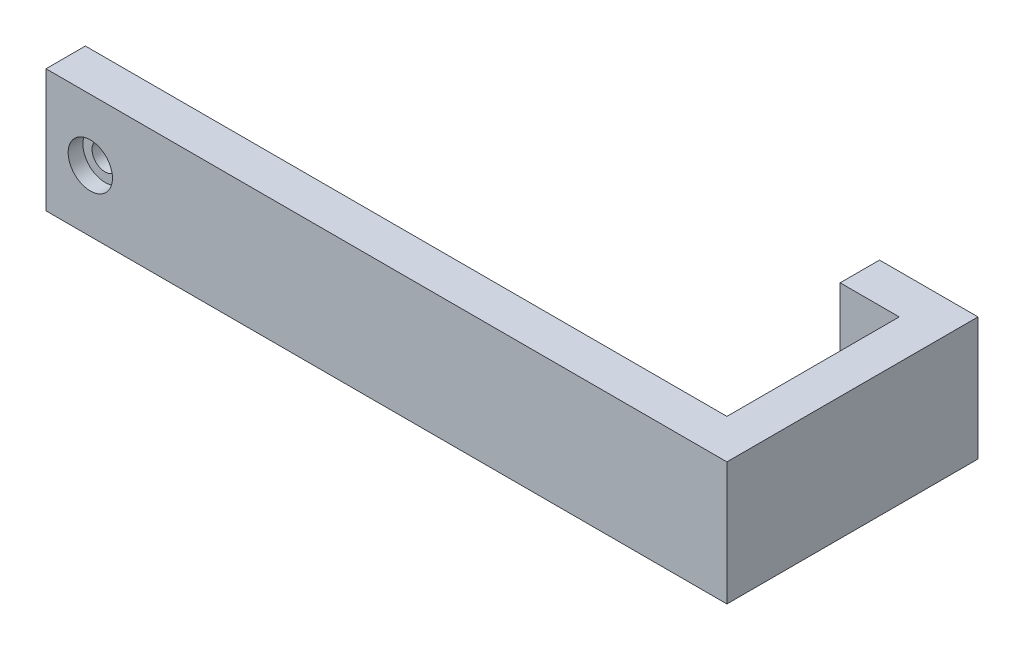
ISO-10303-21;
HEADER;
FILE_DESCRIPTION(('STEP AP214'),'2;1');
FILE_NAME('part.step','',(''),(''),'','','');
FILE_SCHEMA(('AUTOMOTIVE_DESIGN { 1 0 10303 214 1 1 1 1 }'));
ENDSEC;
DATA;
#1=APPLICATION_CONTEXT('core data for automotive mechanical design processes');
#2=APPLICATION_PROTOCOL_DEFINITION('international standard','automotive_design',2000,#1);
#3=PRODUCT_CONTEXT('',#1,'mechanical');
#4=PRODUCT('Part','Part','',(#3));
#5=PRODUCT_RELATED_PRODUCT_CATEGORY('part','',(#4));
#6=PRODUCT_DEFINITION_FORMATION('','',#4);
#7=PRODUCT_DEFINITION_CONTEXT('part definition',#1,'design');
#8=PRODUCT_DEFINITION('design','',#6,#7);
#9=PRODUCT_DEFINITION_SHAPE('','',#8);
#10=(LENGTH_UNIT() NAMED_UNIT(*) SI_UNIT(.MILLI.,.METRE.));
#11=(NAMED_UNIT(*) PLANE_ANGLE_UNIT() SI_UNIT($,.RADIAN.));
#12=(NAMED_UNIT(*) SI_UNIT($,.STERADIAN.) SOLID_ANGLE_UNIT());
#13=UNCERTAINTY_MEASURE_WITH_UNIT(LENGTH_MEASURE(1.E-05),#10,'distance_accuracy_value','');
#14=(GEOMETRIC_REPRESENTATION_CONTEXT(3) GLOBAL_UNCERTAINTY_ASSIGNED_CONTEXT((#13)) GLOBAL_UNIT_ASSIGNED_CONTEXT((#10,
#11,#12)) REPRESENTATION_CONTEXT('',''));
#15=CARTESIAN_POINT('',(0.,0.,0.));
#16=DIRECTION('',(0.,0.,1.));
#17=DIRECTION('',(1.,0.,0.));
#18=AXIS2_PLACEMENT_3D('',#15,#16,#17);
#19=CARTESIAN_POINT('',(0.,0.,8.));
#20=DIRECTION('',(0.,0.,-1.));
#21=DIRECTION('',(-1.,0.,0.));
#22=AXIS2_PLACEMENT_3D('',#19,#20,#21);
#23=CYLINDRICAL_SURFACE('',#22,2.65);
#24=CARTESIAN_POINT('',(0.,0.,0.));
#25=DIRECTION('',(0.,0.,1.));
#26=DIRECTION('',(1.,0.,0.));
#27=AXIS2_PLACEMENT_3D('',#24,#25,#26);
#28=CIRCLE('',#27,2.65);
#29=CARTESIAN_POINT('',(2.65,0.,0.));
#30=VERTEX_POINT('',#29);
#31=EDGE_CURVE('E159',#30,#30,#28,.T.);
#32=ORIENTED_EDGE('',*,*,#31,.F.);
#33=EDGE_LOOP('',(#32));
#34=FACE_BOUND('',#33,.T.);
#35=CARTESIAN_POINT('',(0.,0.,5.));
#36=DIRECTION('',(0.,0.,1.));
#37=DIRECTION('',(1.,0.,0.));
#38=AXIS2_PLACEMENT_3D('',#35,#36,#37);
#39=CIRCLE('',#38,2.65);
#40=CARTESIAN_POINT('',(2.65,0.,5.));
#41=VERTEX_POINT('',#40);
#42=EDGE_CURVE('E41',#41,#41,#39,.T.);
#43=ORIENTED_EDGE('',*,*,#42,.T.);
#44=EDGE_LOOP('',(#43));
#45=FACE_BOUND('',#44,.T.);
#46=ADVANCED_FACE('F37',(#34,#45),#23,.F.);
#47=CARTESIAN_POINT('',(121.3,-12.5,-43.));
#48=DIRECTION('',(1.,0.,0.));
#49=DIRECTION('',(0.,0.,-1.));
#50=AXIS2_PLACEMENT_3D('',#47,#48,#49);
#51=PLANE('',#50);
#52=DIRECTION('',(0.,1.,0.));
#53=VECTOR('',#52,1.);
#54=CARTESIAN_POINT('',(121.3,12.5,-35.));
#55=LINE('',#54,#53);
#56=CARTESIAN_POINT('',(121.3,-12.5,-35.));
#57=VERTEX_POINT('',#56);
#58=CARTESIAN_POINT('',(121.3,12.5,-35.));
#59=VERTEX_POINT('',#58);
#60=EDGE_CURVE('E139',#57,#59,#55,.T.);
#61=ORIENTED_EDGE('',*,*,#60,.F.);
#62=DIRECTION('',(0.,0.,1.));
#63=VECTOR('',#62,1.);
#64=CARTESIAN_POINT('',(121.3,-12.5,-43.));
#65=LINE('',#64,#63);
#66=CARTESIAN_POINT('',(121.3,-12.5,0.));
#67=VERTEX_POINT('',#66);
#68=EDGE_CURVE('E53',#57,#67,#65,.T.);
#69=ORIENTED_EDGE('',*,*,#68,.T.);
#70=DIRECTION('',(0.,1.,0.));
#71=VECTOR('',#70,1.);
#72=CARTESIAN_POINT('',(121.3,-12.5,0.));
#73=LINE('',#72,#71);
#74=CARTESIAN_POINT('',(121.3,12.5,0.));
#75=VERTEX_POINT('',#74);
#76=EDGE_CURVE('E152',#67,#75,#73,.T.);
#77=ORIENTED_EDGE('',*,*,#76,.T.);
#78=DIRECTION('',(0.,0.,1.));
#79=VECTOR('',#78,1.);
#80=CARTESIAN_POINT('',(121.3,12.5,-43.));
#81=LINE('',#80,#79);
#82=EDGE_CURVE('E155',#59,#75,#81,.T.);
#83=ORIENTED_EDGE('',*,*,#82,.F.);
#84=EDGE_LOOP('',(#61,#69,#77,#83));
#85=FACE_BOUND('',#84,.T.);
#86=ADVANCED_FACE('F182',(#85),#51,.F.);
#87=CARTESIAN_POINT('',(0.,0.,0.));
#88=DIRECTION('',(0.,0.,1.));
#89=DIRECTION('',(1.,0.,0.));
#90=AXIS2_PLACEMENT_3D('',#87,#88,#89);
#91=PLANE('',#90);
#92=ORIENTED_EDGE('',*,*,#31,.T.);
#93=EDGE_LOOP('',(#92));
#94=FACE_BOUND('',#93,.T.);
#95=ORIENTED_EDGE('',*,*,#76,.F.);
#96=DIRECTION('',(1.,0.,0.));
#97=VECTOR('',#96,1.);
#98=CARTESIAN_POINT('',(-8.,-12.5,0.));
#99=LINE('',#98,#97);
#100=CARTESIAN_POINT('',(-9.,-12.5,0.));
#101=VERTEX_POINT('',#100);
#102=EDGE_CURVE('E78',#101,#67,#99,.T.);
#103=ORIENTED_EDGE('',*,*,#102,.F.);
#104=DIRECTION('',(0.,-1.,0.));
#105=VECTOR('',#104,1.);
#106=CARTESIAN_POINT('',(-9.,12.5,0.));
#107=LINE('',#106,#105);
#108=CARTESIAN_POINT('',(-9.,12.5,0.));
#109=VERTEX_POINT('',#108);
#110=EDGE_CURVE('E162',#109,#101,#107,.T.);
#111=ORIENTED_EDGE('',*,*,#110,.F.);
#112=DIRECTION('',(-1.,0.,0.));
#113=VECTOR('',#112,1.);
#114=CARTESIAN_POINT('',(-8.,12.5,0.));
#115=LINE('',#114,#113);
#116=EDGE_CURVE('E164',#75,#109,#115,.T.);
#117=ORIENTED_EDGE('',*,*,#116,.F.);
#118=EDGE_LOOP('',(#95,#103,#111,#117));
#119=FACE_BOUND('',#118,.T.);
#120=ADVANCED_FACE('F180',(#94,#119),#91,.F.);
#121=CARTESIAN_POINT('',(0.,0.,8.));
#122=DIRECTION('',(0.,0.,1.));
#123=DIRECTION('',(1.,0.,0.));
#124=AXIS2_PLACEMENT_3D('',#121,#122,#123);
#125=PLANE('',#124);
#126=CARTESIAN_POINT('',(0.,0.,8.));
#127=DIRECTION('',(0.,0.,1.));
#128=DIRECTION('',(1.,0.,0.));
#129=AXIS2_PLACEMENT_3D('',#126,#127,#128);
#130=CIRCLE('',#129,4.5);
#131=CARTESIAN_POINT('',(4.5,0.,8.));
#132=VERTEX_POINT('',#131);
#133=EDGE_CURVE('E143',#132,#132,#130,.T.);
#134=ORIENTED_EDGE('',*,*,#133,.F.);
#135=EDGE_LOOP('',(#134));
#136=FACE_BOUND('',#135,.T.);
#137=DIRECTION('',(-1.,0.,0.));
#138=VECTOR('',#137,1.);
#139=CARTESIAN_POINT('',(-8.,12.5,8.));
#140=LINE('',#139,#138);
#141=CARTESIAN_POINT('',(129.3,12.5,8.));
#142=VERTEX_POINT('',#141);
#143=CARTESIAN_POINT('',(-9.,12.5,8.));
#144=VERTEX_POINT('',#143);
#145=EDGE_CURVE('E62',#142,#144,#140,.T.);
#146=ORIENTED_EDGE('',*,*,#145,.T.);
#147=DIRECTION('',(0.,-1.,0.));
#148=VECTOR('',#147,1.);
#149=CARTESIAN_POINT('',(-9.,12.5,8.));
#150=LINE('',#149,#148);
#151=CARTESIAN_POINT('',(-9.,-12.5,8.));
#152=VERTEX_POINT('',#151);
#153=EDGE_CURVE('E85',#144,#152,#150,.T.);
#154=ORIENTED_EDGE('',*,*,#153,.T.);
#155=DIRECTION('',(1.,0.,0.));
#156=VECTOR('',#155,1.);
#157=CARTESIAN_POINT('',(-9.,-12.5,8.));
#158=LINE('',#157,#156);
#159=CARTESIAN_POINT('',(129.3,-12.5,8.));
#160=VERTEX_POINT('',#159);
#161=EDGE_CURVE('E166',#152,#160,#158,.T.);
#162=ORIENTED_EDGE('',*,*,#161,.T.);
#163=DIRECTION('',(0.,1.,0.));
#164=VECTOR('',#163,1.);
#165=CARTESIAN_POINT('',(129.3,-12.5,8.));
#166=LINE('',#165,#164);
#167=EDGE_CURVE('E168',#160,#142,#166,.T.);
#168=ORIENTED_EDGE('',*,*,#167,.T.);
#169=EDGE_LOOP('',(#146,#154,#162,#168));
#170=FACE_BOUND('',#169,.T.);
#171=ADVANCED_FACE('F206',(#136,#170),#125,.T.);
#172=CARTESIAN_POINT('',(-9.,12.5,8.));
#173=DIRECTION('',(1.,0.,0.));
#174=DIRECTION('',(0.,0.,-1.));
#175=AXIS2_PLACEMENT_3D('',#172,#173,#174);
#176=PLANE('',#175);
#177=ORIENTED_EDGE('',*,*,#110,.T.);
#178=DIRECTION('',(0.,0.,-1.));
#179=VECTOR('',#178,1.);
#180=CARTESIAN_POINT('',(-9.,-12.5,8.));
#181=LINE('',#180,#179);
#182=EDGE_CURVE('E46',#152,#101,#181,.T.);
#183=ORIENTED_EDGE('',*,*,#182,.F.);
#184=ORIENTED_EDGE('',*,*,#153,.F.);
#185=DIRECTION('',(0.,0.,-1.));
#186=VECTOR('',#185,1.);
#187=CARTESIAN_POINT('',(-9.,12.5,8.));
#188=LINE('',#187,#186);
#189=EDGE_CURVE('E11',#144,#109,#188,.T.);
#190=ORIENTED_EDGE('',*,*,#189,.T.);
#191=EDGE_LOOP('',(#177,#183,#184,#190));
#192=FACE_BOUND('',#191,.T.);
#193=ADVANCED_FACE('F39',(#192),#176,.F.);
#194=CARTESIAN_POINT('',(-8.,-12.5,8.));
#195=DIRECTION('',(0.,1.,0.));
#196=DIRECTION('',(0.,0.,1.));
#197=AXIS2_PLACEMENT_3D('',#194,#195,#196);
#198=PLANE('',#197);
#199=ORIENTED_EDGE('',*,*,#102,.T.);
#200=ORIENTED_EDGE('',*,*,#68,.F.);
#201=DIRECTION('',(1.,0.,0.));
#202=VECTOR('',#201,1.);
#203=CARTESIAN_POINT('',(109.3,-12.5,-35.));
#204=LINE('',#203,#202);
#205=CARTESIAN_POINT('',(109.3,-12.5,-35.));
#206=VERTEX_POINT('',#205);
#207=EDGE_CURVE('E130',#206,#57,#204,.T.);
#208=ORIENTED_EDGE('',*,*,#207,.F.);
#209=DIRECTION('',(0.,0.,1.));
#210=VECTOR('',#209,1.);
#211=CARTESIAN_POINT('',(109.3,-12.5,-35.));
#212=LINE('',#211,#210);
#213=CARTESIAN_POINT('',(109.3,-12.5,-43.));
#214=VERTEX_POINT('',#213);
#215=EDGE_CURVE('E128',#214,#206,#212,.T.);
#216=ORIENTED_EDGE('',*,*,#215,.F.);
#217=DIRECTION('',(-1.,0.,0.));
#218=VECTOR('',#217,1.);
#219=CARTESIAN_POINT('',(129.3,-12.5,-43.));
#220=LINE('',#219,#218);
#221=CARTESIAN_POINT('',(129.3,-12.5,-43.));
#222=VERTEX_POINT('',#221);
#223=EDGE_CURVE('E115',#222,#214,#220,.T.);
#224=ORIENTED_EDGE('',*,*,#223,.F.);
#225=DIRECTION('',(0.,0.,-1.));
#226=VECTOR('',#225,1.);
#227=CARTESIAN_POINT('',(129.3,-12.5,8.));
#228=LINE('',#227,#226);
#229=EDGE_CURVE('E175',#160,#222,#228,.T.);
#230=ORIENTED_EDGE('',*,*,#229,.F.);
#231=ORIENTED_EDGE('',*,*,#161,.F.);
#232=ORIENTED_EDGE('',*,*,#182,.T.);
#233=EDGE_LOOP('',(#199,#200,#208,#216,#224,#230,#231,#232));
#234=FACE_BOUND('',#233,.T.);
#235=ADVANCED_FACE('F129',(#234),#198,.F.);
#236=CARTESIAN_POINT('',(129.3,-12.5,8.));
#237=DIRECTION('',(-1.,0.,0.));
#238=DIRECTION('',(0.,0.,1.));
#239=AXIS2_PLACEMENT_3D('',#236,#237,#238);
#240=PLANE('',#239);
#241=ORIENTED_EDGE('',*,*,#229,.T.);
#242=DIRECTION('',(0.,-1.,0.));
#243=VECTOR('',#242,1.);
#244=CARTESIAN_POINT('',(129.3,12.5,-43.));
#245=LINE('',#244,#243);
#246=CARTESIAN_POINT('',(129.3,12.5,-43.));
#247=VERTEX_POINT('',#246);
#248=EDGE_CURVE('E122',#247,#222,#245,.T.);
#249=ORIENTED_EDGE('',*,*,#248,.F.);
#250=DIRECTION('',(0.,0.,-1.));
#251=VECTOR('',#250,1.);
#252=CARTESIAN_POINT('',(129.3,12.5,8.));
#253=LINE('',#252,#251);
#254=EDGE_CURVE('E170',#142,#247,#253,.T.);
#255=ORIENTED_EDGE('',*,*,#254,.F.);
#256=ORIENTED_EDGE('',*,*,#167,.F.);
#257=EDGE_LOOP('',(#241,#249,#255,#256));
#258=FACE_BOUND('',#257,.T.);
#259=ADVANCED_FACE('F215',(#258),#240,.F.);
#260=CARTESIAN_POINT('',(-8.,12.5,8.));
#261=DIRECTION('',(0.,-1.,0.));
#262=DIRECTION('',(0.,0.,-1.));
#263=AXIS2_PLACEMENT_3D('',#260,#261,#262);
#264=PLANE('',#263);
#265=ORIENTED_EDGE('',*,*,#254,.T.);
#266=DIRECTION('',(1.,0.,0.));
#267=VECTOR('',#266,1.);
#268=CARTESIAN_POINT('',(129.3,12.5,-43.));
#269=LINE('',#268,#267);
#270=CARTESIAN_POINT('',(109.3,12.5,-43.));
#271=VERTEX_POINT('',#270);
#272=EDGE_CURVE('E125',#271,#247,#269,.T.);
#273=ORIENTED_EDGE('',*,*,#272,.F.);
#274=DIRECTION('',(0.,0.,-1.));
#275=VECTOR('',#274,1.);
#276=CARTESIAN_POINT('',(109.3,12.5,-43.));
#277=LINE('',#276,#275);
#278=CARTESIAN_POINT('',(109.3,12.5,-35.));
#279=VERTEX_POINT('',#278);
#280=EDGE_CURVE('E138',#279,#271,#277,.T.);
#281=ORIENTED_EDGE('',*,*,#280,.F.);
#282=DIRECTION('',(1.,0.,0.));
#283=VECTOR('',#282,1.);
#284=CARTESIAN_POINT('',(109.3,12.5,-35.));
#285=LINE('',#284,#283);
#286=EDGE_CURVE('E147',#279,#59,#285,.T.);
#287=ORIENTED_EDGE('',*,*,#286,.T.);
#288=ORIENTED_EDGE('',*,*,#82,.T.);
#289=ORIENTED_EDGE('',*,*,#116,.T.);
#290=ORIENTED_EDGE('',*,*,#189,.F.);
#291=ORIENTED_EDGE('',*,*,#145,.F.);
#292=EDGE_LOOP('',(#265,#273,#281,#287,#288,#289,#290,#291));
#293=FACE_BOUND('',#292,.T.);
#294=ADVANCED_FACE('F183',(#293),#264,.F.);
#295=CARTESIAN_POINT('',(0.,0.,-43.));
#296=DIRECTION('',(0.,0.,-1.));
#297=DIRECTION('',(-1.,0.,0.));
#298=AXIS2_PLACEMENT_3D('',#295,#296,#297);
#299=PLANE('',#298);
#300=ORIENTED_EDGE('',*,*,#248,.T.);
#301=ORIENTED_EDGE('',*,*,#223,.T.);
#302=DIRECTION('',(0.,-1.,0.));
#303=VECTOR('',#302,1.);
#304=CARTESIAN_POINT('',(109.3,12.5,-43.));
#305=LINE('',#304,#303);
#306=EDGE_CURVE('E120',#271,#214,#305,.T.);
#307=ORIENTED_EDGE('',*,*,#306,.F.);
#308=ORIENTED_EDGE('',*,*,#272,.T.);
#309=EDGE_LOOP('',(#300,#301,#307,#308));
#310=FACE_BOUND('',#309,.T.);
#311=ADVANCED_FACE('F117',(#310),#299,.T.);
#312=CARTESIAN_POINT('',(109.3,12.5,-35.));
#313=DIRECTION('',(0.,0.,-1.));
#314=DIRECTION('',(-1.,0.,0.));
#315=AXIS2_PLACEMENT_3D('',#312,#313,#314);
#316=PLANE('',#315);
#317=ORIENTED_EDGE('',*,*,#60,.T.);
#318=ORIENTED_EDGE('',*,*,#286,.F.);
#319=DIRECTION('',(0.,1.,0.));
#320=VECTOR('',#319,1.);
#321=CARTESIAN_POINT('',(109.3,12.5,-35.));
#322=LINE('',#321,#320);
#323=EDGE_CURVE('E133',#206,#279,#322,.T.);
#324=ORIENTED_EDGE('',*,*,#323,.F.);
#325=ORIENTED_EDGE('',*,*,#207,.T.);
#326=EDGE_LOOP('',(#317,#318,#324,#325));
#327=FACE_BOUND('',#326,.T.);
#328=ADVANCED_FACE('F186',(#327),#316,.F.);
#329=CARTESIAN_POINT('',(109.3,0.,0.));
#330=DIRECTION('',(1.,0.,0.));
#331=DIRECTION('',(0.,0.,-1.));
#332=AXIS2_PLACEMENT_3D('',#329,#330,#331);
#333=PLANE('',#332);
#334=ORIENTED_EDGE('',*,*,#306,.T.);
#335=ORIENTED_EDGE('',*,*,#215,.T.);
#336=ORIENTED_EDGE('',*,*,#323,.T.);
#337=ORIENTED_EDGE('',*,*,#280,.T.);
#338=EDGE_LOOP('',(#334,#335,#336,#337));
#339=FACE_BOUND('',#338,.T.);
#340=ADVANCED_FACE('F136',(#339),#333,.F.);
#341=CARTESIAN_POINT('',(0.,0.,5.));
#342=DIRECTION('',(0.,0.,1.));
#343=DIRECTION('',(1.,0.,0.));
#344=AXIS2_PLACEMENT_3D('',#341,#342,#343);
#345=CYLINDRICAL_SURFACE('',#344,4.5);
#346=CARTESIAN_POINT('',(0.,0.,5.));
#347=DIRECTION('',(0.,0.,1.));
#348=DIRECTION('',(1.,0.,0.));
#349=AXIS2_PLACEMENT_3D('',#346,#347,#348);
#350=CIRCLE('',#349,4.5);
#351=CARTESIAN_POINT('',(4.5,0.,5.));
#352=VERTEX_POINT('',#351);
#353=EDGE_CURVE('E300',#352,#352,#350,.T.);
#354=ORIENTED_EDGE('',*,*,#353,.F.);
#355=EDGE_LOOP('',(#354));
#356=FACE_BOUND('',#355,.T.);
#357=ORIENTED_EDGE('',*,*,#133,.T.);
#358=EDGE_LOOP('',(#357));
#359=FACE_BOUND('',#358,.T.);
#360=ADVANCED_FACE('F193',(#356,#359),#345,.F.);
#361=CARTESIAN_POINT('',(0.,0.,5.));
#362=DIRECTION('',(0.,0.,1.));
#363=DIRECTION('',(1.,0.,0.));
#364=AXIS2_PLACEMENT_3D('',#361,#362,#363);
#365=PLANE('',#364);
#366=ORIENTED_EDGE('',*,*,#42,.F.);
#367=EDGE_LOOP('',(#366));
#368=FACE_BOUND('',#367,.T.);
#369=ORIENTED_EDGE('',*,*,#353,.T.);
#370=EDGE_LOOP('',(#369));
#371=FACE_BOUND('',#370,.T.);
#372=ADVANCED_FACE('F282',(#368,#371),#365,.T.);
#373=CLOSED_SHELL('',(#46,#86,#120,#171,#193,#235,#259,#294,#311,#328,#340,#360,#372));
#374=MANIFOLD_SOLID_BREP('B2',#373);
#375=ADVANCED_BREP_SHAPE_REPRESENTATION('',(#18,#374),#14);
#376=SHAPE_DEFINITION_REPRESENTATION(#9,#375);
ENDSEC;
END-ISO-10303-21;
